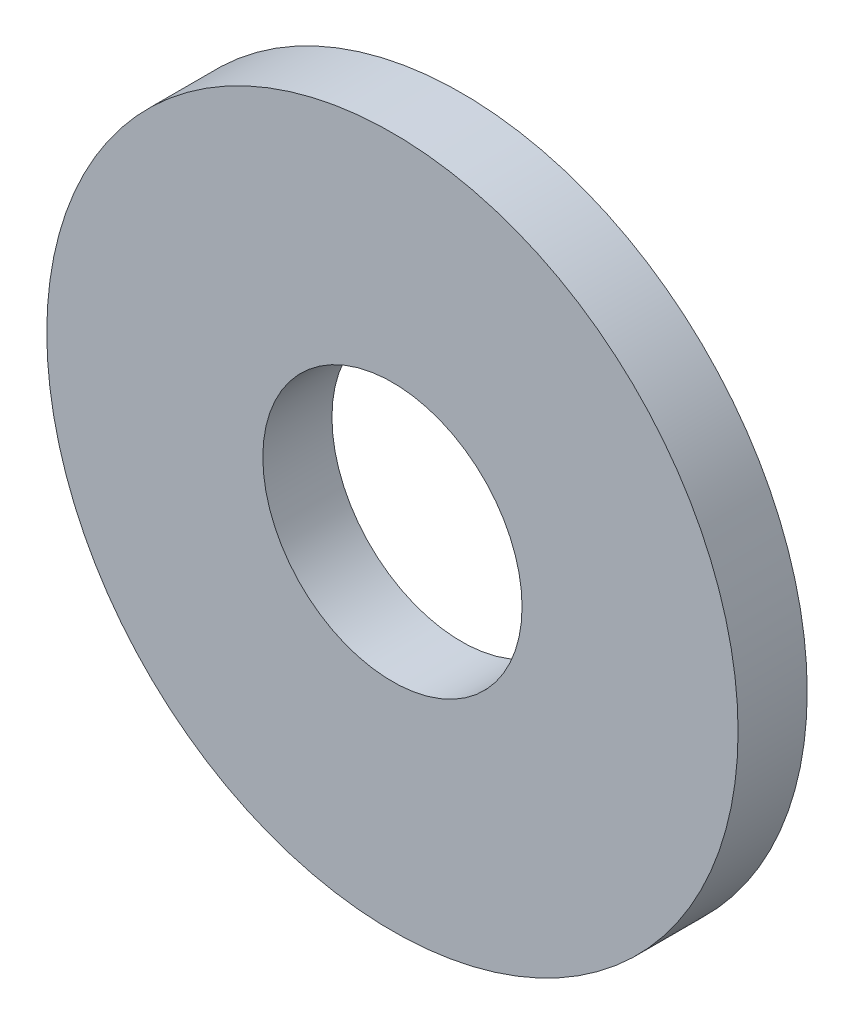
ISO-10303-21;
HEADER;
FILE_DESCRIPTION(('STEP AP214'),'2;1');
FILE_NAME('part.step','',(''),(''),'','','');
FILE_SCHEMA(('AUTOMOTIVE_DESIGN { 1 0 10303 214 1 1 1 1 }'));
ENDSEC;
DATA;
#1=APPLICATION_CONTEXT('core data for automotive mechanical design processes');
#2=APPLICATION_PROTOCOL_DEFINITION('international standard','automotive_design',2000,#1);
#3=PRODUCT_CONTEXT('',#1,'mechanical');
#4=PRODUCT('Part','Part','',(#3));
#5=PRODUCT_RELATED_PRODUCT_CATEGORY('part','',(#4));
#6=PRODUCT_DEFINITION_FORMATION('','',#4);
#7=PRODUCT_DEFINITION_CONTEXT('part definition',#1,'design');
#8=PRODUCT_DEFINITION('design','',#6,#7);
#9=PRODUCT_DEFINITION_SHAPE('','',#8);
#10=(LENGTH_UNIT() NAMED_UNIT(*) SI_UNIT(.MILLI.,.METRE.));
#11=(NAMED_UNIT(*) PLANE_ANGLE_UNIT() SI_UNIT($,.RADIAN.));
#12=(NAMED_UNIT(*) SI_UNIT($,.STERADIAN.) SOLID_ANGLE_UNIT());
#13=UNCERTAINTY_MEASURE_WITH_UNIT(LENGTH_MEASURE(1.E-05),#10,'distance_accuracy_value','');
#14=(GEOMETRIC_REPRESENTATION_CONTEXT(3) GLOBAL_UNCERTAINTY_ASSIGNED_CONTEXT((#13)) GLOBAL_UNIT_ASSIGNED_CONTEXT((#10,
#11,#12)) REPRESENTATION_CONTEXT('',''));
#15=CARTESIAN_POINT('',(0.,0.,0.));
#16=DIRECTION('',(0.,0.,1.));
#17=DIRECTION('',(1.,0.,0.));
#18=AXIS2_PLACEMENT_3D('',#15,#16,#17);
#19=CARTESIAN_POINT('',(0.,0.,0.8));
#20=DIRECTION('',(0.,0.,1.));
#21=DIRECTION('',(1.,0.,0.));
#22=AXIS2_PLACEMENT_3D('',#19,#20,#21);
#23=PLANE('',#22);
#24=CARTESIAN_POINT('',(0.,0.,0.8));
#25=DIRECTION('',(0.,0.,1.));
#26=DIRECTION('',(1.,0.,0.));
#27=AXIS2_PLACEMENT_3D('',#24,#25,#26);
#28=CIRCLE('',#27,4.);
#29=CARTESIAN_POINT('',(4.,0.,0.8));
#30=VERTEX_POINT('',#29);
#31=EDGE_CURVE('E10',#30,#30,#28,.T.);
#32=ORIENTED_EDGE('',*,*,#31,.T.);
#33=EDGE_LOOP('',(#32));
#34=FACE_BOUND('',#33,.T.);
#35=CARTESIAN_POINT('',(0.,0.,0.8));
#36=DIRECTION('',(0.,0.,1.));
#37=DIRECTION('',(1.,0.,0.));
#38=AXIS2_PLACEMENT_3D('',#35,#36,#37);
#39=CIRCLE('',#38,1.5);
#40=CARTESIAN_POINT('',(1.5,0.,0.8));
#41=VERTEX_POINT('',#40);
#42=EDGE_CURVE('E42',#41,#41,#39,.T.);
#43=ORIENTED_EDGE('',*,*,#42,.F.);
#44=EDGE_LOOP('',(#43));
#45=FACE_BOUND('',#44,.T.);
#46=ADVANCED_FACE('F31',(#34,#45),#23,.T.);
#47=CARTESIAN_POINT('',(0.,0.,0.));
#48=DIRECTION('',(0.,0.,1.));
#49=DIRECTION('',(1.,0.,0.));
#50=AXIS2_PLACEMENT_3D('',#47,#48,#49);
#51=PLANE('',#50);
#52=CARTESIAN_POINT('',(0.,0.,0.));
#53=DIRECTION('',(0.,0.,1.));
#54=DIRECTION('',(1.,0.,0.));
#55=AXIS2_PLACEMENT_3D('',#52,#53,#54);
#56=CIRCLE('',#55,4.);
#57=CARTESIAN_POINT('',(4.,0.,0.));
#58=VERTEX_POINT('',#57);
#59=EDGE_CURVE('E35',#58,#58,#56,.T.);
#60=ORIENTED_EDGE('',*,*,#59,.F.);
#61=EDGE_LOOP('',(#60));
#62=FACE_BOUND('',#61,.T.);
#63=CARTESIAN_POINT('',(0.,0.,0.));
#64=DIRECTION('',(0.,0.,1.));
#65=DIRECTION('',(1.,0.,0.));
#66=AXIS2_PLACEMENT_3D('',#63,#64,#65);
#67=CIRCLE('',#66,1.5);
#68=CARTESIAN_POINT('',(1.5,0.,0.));
#69=VERTEX_POINT('',#68);
#70=EDGE_CURVE('E44',#69,#69,#67,.T.);
#71=ORIENTED_EDGE('',*,*,#70,.T.);
#72=EDGE_LOOP('',(#71));
#73=FACE_BOUND('',#72,.T.);
#74=ADVANCED_FACE('F54',(#62,#73),#51,.F.);
#75=CARTESIAN_POINT('',(0.,0.,0.8));
#76=DIRECTION('',(0.,0.,-1.));
#77=DIRECTION('',(-1.,0.,0.));
#78=AXIS2_PLACEMENT_3D('',#75,#76,#77);
#79=CYLINDRICAL_SURFACE('',#78,4.);
#80=ORIENTED_EDGE('',*,*,#31,.F.);
#81=EDGE_LOOP('',(#80));
#82=FACE_BOUND('',#81,.T.);
#83=ORIENTED_EDGE('',*,*,#59,.T.);
#84=EDGE_LOOP('',(#83));
#85=FACE_BOUND('',#84,.T.);
#86=ADVANCED_FACE('F33',(#82,#85),#79,.T.);
#87=CARTESIAN_POINT('',(0.,0.,0.8));
#88=DIRECTION('',(0.,0.,-1.));
#89=DIRECTION('',(-1.,0.,0.));
#90=AXIS2_PLACEMENT_3D('',#87,#88,#89);
#91=CYLINDRICAL_SURFACE('',#90,1.5);
#92=ORIENTED_EDGE('',*,*,#42,.T.);
#93=EDGE_LOOP('',(#92));
#94=FACE_BOUND('',#93,.T.);
#95=ORIENTED_EDGE('',*,*,#70,.F.);
#96=EDGE_LOOP('',(#95));
#97=FACE_BOUND('',#96,.T.);
#98=ADVANCED_FACE('F50',(#94,#97),#91,.F.);
#99=CLOSED_SHELL('',(#46,#74,#86,#98));
#100=MANIFOLD_SOLID_BREP('B2',#99);
#101=ADVANCED_BREP_SHAPE_REPRESENTATION('',(#18,#100),#14);
#102=SHAPE_DEFINITION_REPRESENTATION(#9,#101);
ENDSEC;
END-ISO-10303-21;
